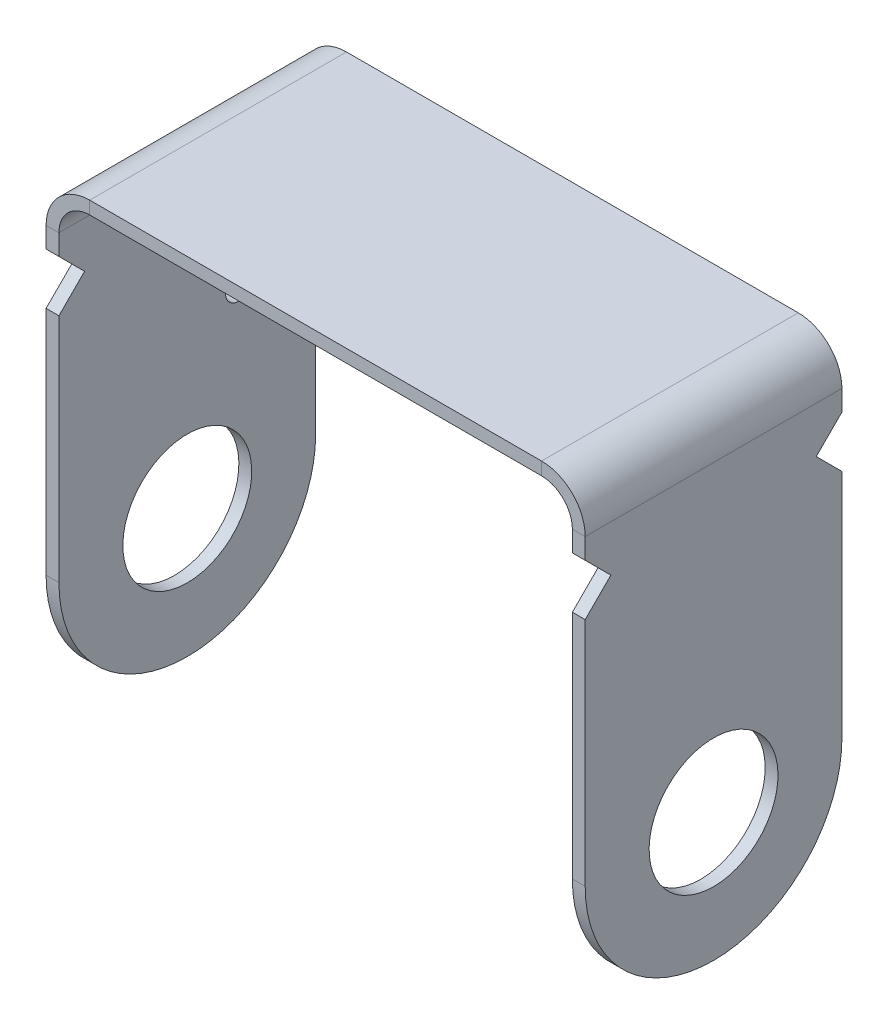
ISO-10303-21;
HEADER;
FILE_DESCRIPTION(('STEP AP214'),'2;1');
FILE_NAME('part.step','',(''),(''),'','','');
FILE_SCHEMA(('AUTOMOTIVE_DESIGN { 1 0 10303 214 1 1 1 1 }'));
ENDSEC;
DATA;
#1=APPLICATION_CONTEXT('core data for automotive mechanical design processes');
#2=APPLICATION_PROTOCOL_DEFINITION('international standard','automotive_design',2000,#1);
#3=PRODUCT_CONTEXT('',#1,'mechanical');
#4=PRODUCT('Part','Part','',(#3));
#5=PRODUCT_RELATED_PRODUCT_CATEGORY('part','',(#4));
#6=PRODUCT_DEFINITION_FORMATION('','',#4);
#7=PRODUCT_DEFINITION_CONTEXT('part definition',#1,'design');
#8=PRODUCT_DEFINITION('design','',#6,#7);
#9=PRODUCT_DEFINITION_SHAPE('','',#8);
#10=(LENGTH_UNIT() NAMED_UNIT(*) SI_UNIT(.MILLI.,.METRE.));
#11=(NAMED_UNIT(*) PLANE_ANGLE_UNIT() SI_UNIT($,.RADIAN.));
#12=(NAMED_UNIT(*) SI_UNIT($,.STERADIAN.) SOLID_ANGLE_UNIT());
#13=UNCERTAINTY_MEASURE_WITH_UNIT(LENGTH_MEASURE(1.E-05),#10,'distance_accuracy_value','');
#14=(GEOMETRIC_REPRESENTATION_CONTEXT(3) GLOBAL_UNCERTAINTY_ASSIGNED_CONTEXT((#13)) GLOBAL_UNIT_ASSIGNED_CONTEXT((#10,
#11,#12)) REPRESENTATION_CONTEXT('',''));
#15=CARTESIAN_POINT('',(0.,0.,0.));
#16=DIRECTION('',(0.,0.,1.));
#17=DIRECTION('',(1.,0.,0.));
#18=AXIS2_PLACEMENT_3D('',#15,#16,#17);
#19=CARTESIAN_POINT('',(-87.9999999999999,180.,-50.));
#20=DIRECTION('',(0.,0.,-1.));
#21=DIRECTION('',(-1.,0.,0.));
#22=AXIS2_PLACEMENT_3D('',#19,#20,#21);
#23=PLANE('',#22);
#24=DIRECTION('',(-1.,0.,0.));
#25=VECTOR('',#24,1.);
#26=CARTESIAN_POINT('',(105.,160.,-50.));
#27=LINE('',#26,#25);
#28=CARTESIAN_POINT('',(-100.,160.,-50.));
#29=VERTEX_POINT('',#28);
#30=CARTESIAN_POINT('',(-105.,160.,-50.));
#31=VERTEX_POINT('',#30);
#32=EDGE_CURVE('E238',#29,#31,#27,.T.);
#33=ORIENTED_EDGE('',*,*,#32,.T.);
#34=DIRECTION('',(0.,1.,0.));
#35=VECTOR('',#34,1.);
#36=CARTESIAN_POINT('',(-105.,0.,-50.));
#37=LINE('',#36,#35);
#38=CARTESIAN_POINT('',(-105.,168.,-50.0000000000001));
#39=VERTEX_POINT('',#38);
#40=EDGE_CURVE('E353',#31,#39,#37,.T.);
#41=ORIENTED_EDGE('',*,*,#40,.T.);
#42=DIRECTION('',(1.,0.,0.));
#43=VECTOR('',#42,1.);
#44=CARTESIAN_POINT('',(-105.,168.,-50.0000000000001));
#45=LINE('',#44,#43);
#46=CARTESIAN_POINT('',(-99.9999999999999,168.,-50.0000000000001));
#47=VERTEX_POINT('',#46);
#48=EDGE_CURVE('E401',#39,#47,#45,.T.);
#49=ORIENTED_EDGE('',*,*,#48,.T.);
#50=DIRECTION('',(0.,1.,0.));
#51=VECTOR('',#50,1.);
#52=CARTESIAN_POINT('',(-100.,0.,-50.));
#53=LINE('',#52,#51);
#54=EDGE_CURVE('E356',#29,#47,#53,.T.);
#55=ORIENTED_EDGE('',*,*,#54,.F.);
#56=EDGE_LOOP('',(#33,#41,#49,#55));
#57=FACE_BOUND('',#56,.T.);
#58=ADVANCED_FACE('F57',(#57),#23,.T.);
#59=CARTESIAN_POINT('',(88.0000000000001,180.,49.9999999999999));
#60=DIRECTION('',(0.,0.,1.));
#61=DIRECTION('',(1.,0.,0.));
#62=AXIS2_PLACEMENT_3D('',#59,#60,#61);
#63=PLANE('',#62);
#64=DIRECTION('',(-1.,0.,0.));
#65=VECTOR('',#64,1.);
#66=CARTESIAN_POINT('',(105.,160.,50.));
#67=LINE('',#66,#65);
#68=CARTESIAN_POINT('',(105.,160.,50.));
#69=VERTEX_POINT('',#68);
#70=CARTESIAN_POINT('',(100.,160.,50.));
#71=VERTEX_POINT('',#70);
#72=EDGE_CURVE('E272',#69,#71,#67,.T.);
#73=ORIENTED_EDGE('',*,*,#72,.F.);
#74=DIRECTION('',(0.,-1.,0.));
#75=VECTOR('',#74,1.);
#76=CARTESIAN_POINT('',(105.,185.,49.9999999999999));
#77=LINE('',#76,#75);
#78=CARTESIAN_POINT('',(105.,168.,50.));
#79=VERTEX_POINT('',#78);
#80=EDGE_CURVE('E311',#79,#69,#77,.T.);
#81=ORIENTED_EDGE('',*,*,#80,.F.);
#82=DIRECTION('',(-1.,0.,0.));
#83=VECTOR('',#82,1.);
#84=CARTESIAN_POINT('',(105.,168.,50.));
#85=LINE('',#84,#83);
#86=CARTESIAN_POINT('',(100.,168.,50.));
#87=VERTEX_POINT('',#86);
#88=EDGE_CURVE('E397',#79,#87,#85,.T.);
#89=ORIENTED_EDGE('',*,*,#88,.T.);
#90=DIRECTION('',(0.,1.,0.));
#91=VECTOR('',#90,1.);
#92=CARTESIAN_POINT('',(100.,185.,49.9999999999999));
#93=LINE('',#92,#91);
#94=EDGE_CURVE('E306',#87,#71,#93,.F.);
#95=ORIENTED_EDGE('',*,*,#94,.T.);
#96=EDGE_LOOP('',(#73,#81,#89,#95));
#97=FACE_BOUND('',#96,.T.);
#98=ADVANCED_FACE('F481',(#97),#63,.T.);
#99=CARTESIAN_POINT('',(88.0000000000001,168.,50.));
#100=DIRECTION('',(0.,0.,1.));
#101=DIRECTION('',(1.,0.,0.));
#102=AXIS2_PLACEMENT_3D('',#99,#100,#101);
#103=PLANE('',#102);
#104=DIRECTION('',(-1.,0.,0.));
#105=VECTOR('',#104,1.);
#106=CARTESIAN_POINT('',(88.,160.,50.));
#107=LINE('',#106,#105);
#108=CARTESIAN_POINT('',(-100.,160.,50.));
#109=VERTEX_POINT('',#108);
#110=CARTESIAN_POINT('',(-105.,160.,50.));
#111=VERTEX_POINT('',#110);
#112=EDGE_CURVE('E412',#109,#111,#107,.T.);
#113=ORIENTED_EDGE('',*,*,#112,.F.);
#114=DIRECTION('',(0.,1.,0.));
#115=VECTOR('',#114,1.);
#116=CARTESIAN_POINT('',(-100.,0.,50.));
#117=LINE('',#116,#115);
#118=CARTESIAN_POINT('',(-99.9999999999999,168.,50.));
#119=VERTEX_POINT('',#118);
#120=EDGE_CURVE('E326',#109,#119,#117,.T.);
#121=ORIENTED_EDGE('',*,*,#120,.T.);
#122=DIRECTION('',(-1.,0.,0.));
#123=VECTOR('',#122,1.);
#124=CARTESIAN_POINT('',(-99.9999999999999,168.,50.));
#125=LINE('',#124,#123);
#126=CARTESIAN_POINT('',(-105.,168.,50.));
#127=VERTEX_POINT('',#126);
#128=EDGE_CURVE('E404',#119,#127,#125,.T.);
#129=ORIENTED_EDGE('',*,*,#128,.T.);
#130=DIRECTION('',(0.,1.,0.));
#131=VECTOR('',#130,1.);
#132=CARTESIAN_POINT('',(-105.,0.,50.));
#133=LINE('',#132,#131);
#134=EDGE_CURVE('E323',#111,#127,#133,.T.);
#135=ORIENTED_EDGE('',*,*,#134,.F.);
#136=EDGE_LOOP('',(#113,#121,#129,#135));
#137=FACE_BOUND('',#136,.T.);
#138=ADVANCED_FACE('F488',(#137),#103,.T.);
#139=CARTESIAN_POINT('',(88.0000000000001,168.,-50.0000000000001));
#140=DIRECTION('',(0.,0.,1.));
#141=DIRECTION('',(1.,0.,0.));
#142=AXIS2_PLACEMENT_3D('',#139,#140,#141);
#143=PLANE('',#142);
#144=DIRECTION('',(0.,-1.,0.));
#145=VECTOR('',#144,1.);
#146=CARTESIAN_POINT('',(105.,185.,-50.0000000000001));
#147=LINE('',#146,#145);
#148=CARTESIAN_POINT('',(105.,168.,-50.0000000000001));
#149=VERTEX_POINT('',#148);
#150=CARTESIAN_POINT('',(105.,160.,-50.));
#151=VERTEX_POINT('',#150);
#152=EDGE_CURVE('E342',#149,#151,#147,.T.);
#153=ORIENTED_EDGE('',*,*,#152,.T.);
#154=CARTESIAN_POINT('',(100.,160.,-50.));
#155=VERTEX_POINT('',#154);
#156=EDGE_CURVE('E245',#151,#155,#27,.T.);
#157=ORIENTED_EDGE('',*,*,#156,.T.);
#158=DIRECTION('',(0.,1.,0.));
#159=VECTOR('',#158,1.);
#160=CARTESIAN_POINT('',(100.,185.,-50.0000000000001));
#161=LINE('',#160,#159);
#162=CARTESIAN_POINT('',(100.,168.,-50.0000000000001));
#163=VERTEX_POINT('',#162);
#164=EDGE_CURVE('E339',#163,#155,#161,.F.);
#165=ORIENTED_EDGE('',*,*,#164,.F.);
#166=DIRECTION('',(1.,0.,0.));
#167=VECTOR('',#166,1.);
#168=CARTESIAN_POINT('',(100.,168.,-50.0000000000001));
#169=LINE('',#168,#167);
#170=EDGE_CURVE('E391',#163,#149,#169,.T.);
#171=ORIENTED_EDGE('',*,*,#170,.T.);
#172=EDGE_LOOP('',(#153,#157,#165,#171));
#173=FACE_BOUND('',#172,.T.);
#174=ADVANCED_FACE('F619',(#173),#143,.F.);
#175=CARTESIAN_POINT('',(-87.9999999999999,185.,49.9999999999999));
#176=DIRECTION('',(0.,0.,1.));
#177=DIRECTION('',(1.,0.,0.));
#178=AXIS2_PLACEMENT_3D('',#175,#176,#177);
#179=PLANE('',#178);
#180=DIRECTION('',(0.,-1.,0.));
#181=VECTOR('',#180,1.);
#182=CARTESIAN_POINT('',(-87.9999999999999,185.,49.9999999999999));
#183=LINE('',#182,#181);
#184=CARTESIAN_POINT('',(-87.9999999999999,185.,49.9999999999999));
#185=VERTEX_POINT('',#184);
#186=CARTESIAN_POINT('',(-87.9999999999999,180.,49.9999999999999));
#187=VERTEX_POINT('',#186);
#188=EDGE_CURVE('E407',#185,#187,#183,.T.);
#189=ORIENTED_EDGE('',*,*,#188,.F.);
#190=CARTESIAN_POINT('',(-87.9999999999999,168.,50.));
#191=DIRECTION('',(0.,0.,1.));
#192=DIRECTION('',(1.,0.,0.));
#193=AXIS2_PLACEMENT_3D('',#190,#191,#192);
#194=CIRCLE('',#193,17.);
#195=EDGE_CURVE('E320',#127,#185,#194,.F.);
#196=ORIENTED_EDGE('',*,*,#195,.F.);
#197=ORIENTED_EDGE('',*,*,#128,.F.);
#198=CARTESIAN_POINT('',(-87.9999999999999,168.,50.));
#199=DIRECTION('',(0.,0.,1.));
#200=DIRECTION('',(1.,0.,0.));
#201=AXIS2_PLACEMENT_3D('',#198,#199,#200);
#202=CIRCLE('',#201,12.);
#203=EDGE_CURVE('E329',#119,#187,#202,.F.);
#204=ORIENTED_EDGE('',*,*,#203,.T.);
#205=EDGE_LOOP('',(#189,#196,#197,#204));
#206=FACE_BOUND('',#205,.T.);
#207=ADVANCED_FACE('F571',(#206),#179,.T.);
#208=CARTESIAN_POINT('',(-99.9999999999999,168.,50.));
#209=DIRECTION('',(0.,0.,1.));
#210=DIRECTION('',(1.,0.,0.));
#211=AXIS2_PLACEMENT_3D('',#208,#209,#210);
#212=PLANE('',#211);
#213=DIRECTION('',(1.,0.,0.));
#214=VECTOR('',#213,1.);
#215=CARTESIAN_POINT('',(-105.,185.,49.9999999999999));
#216=LINE('',#215,#214);
#217=CARTESIAN_POINT('',(88.0000000000001,185.,49.9999999999999));
#218=VERTEX_POINT('',#217);
#219=EDGE_CURVE('E317',#185,#218,#216,.T.);
#220=ORIENTED_EDGE('',*,*,#219,.F.);
#221=ORIENTED_EDGE('',*,*,#188,.T.);
#222=DIRECTION('',(1.,0.,0.));
#223=VECTOR('',#222,1.);
#224=CARTESIAN_POINT('',(-105.,180.,49.9999999999999));
#225=LINE('',#224,#223);
#226=CARTESIAN_POINT('',(88.0000000000001,180.,49.9999999999999));
#227=VERTEX_POINT('',#226);
#228=EDGE_CURVE('E332',#187,#227,#225,.T.);
#229=ORIENTED_EDGE('',*,*,#228,.T.);
#230=DIRECTION('',(0.,1.,0.));
#231=VECTOR('',#230,1.);
#232=CARTESIAN_POINT('',(88.0000000000001,180.,49.9999999999999));
#233=LINE('',#232,#231);
#234=EDGE_CURVE('E395',#227,#218,#233,.T.);
#235=ORIENTED_EDGE('',*,*,#234,.T.);
#236=EDGE_LOOP('',(#220,#221,#229,#235));
#237=FACE_BOUND('',#236,.T.);
#238=ADVANCED_FACE('F504',(#237),#212,.T.);
#239=CARTESIAN_POINT('',(-105.,168.,-50.0000000000001));
#240=DIRECTION('',(0.,0.,-1.));
#241=DIRECTION('',(-1.,0.,0.));
#242=AXIS2_PLACEMENT_3D('',#239,#240,#241);
#243=PLANE('',#242);
#244=ORIENTED_EDGE('',*,*,#48,.F.);
#245=CARTESIAN_POINT('',(-87.9999999999999,168.,-50.0000000000001));
#246=DIRECTION('',(0.,0.,1.));
#247=DIRECTION('',(1.,0.,0.));
#248=AXIS2_PLACEMENT_3D('',#245,#246,#247);
#249=CIRCLE('',#248,17.);
#250=CARTESIAN_POINT('',(-87.9999999999999,185.,-50.0000000000001));
#251=VERTEX_POINT('',#250);
#252=EDGE_CURVE('E350',#39,#251,#249,.F.);
#253=ORIENTED_EDGE('',*,*,#252,.T.);
#254=DIRECTION('',(0.,1.,0.));
#255=VECTOR('',#254,1.);
#256=CARTESIAN_POINT('',(-87.9999999999999,180.,-50.));
#257=LINE('',#256,#255);
#258=CARTESIAN_POINT('',(-87.9999999999999,180.,-50.));
#259=VERTEX_POINT('',#258);
#260=EDGE_CURVE('E399',#259,#251,#257,.T.);
#261=ORIENTED_EDGE('',*,*,#260,.F.);
#262=CARTESIAN_POINT('',(-87.9999999999999,168.,-50.0000000000001));
#263=DIRECTION('',(0.,0.,1.));
#264=DIRECTION('',(1.,0.,0.));
#265=AXIS2_PLACEMENT_3D('',#262,#263,#264);
#266=CIRCLE('',#265,12.);
#267=EDGE_CURVE('E359',#47,#259,#266,.F.);
#268=ORIENTED_EDGE('',*,*,#267,.F.);
#269=EDGE_LOOP('',(#244,#253,#261,#268));
#270=FACE_BOUND('',#269,.T.);
#271=ADVANCED_FACE('F497',(#270),#243,.T.);
#272=CARTESIAN_POINT('',(-100.,50.,-50.));
#273=VERTEX_POINT('',#272);
#274=CARTESIAN_POINT('',(-100.,140.,-50.));
#275=VERTEX_POINT('',#274);
#276=EDGE_CURVE('E357',#273,#275,#53,.T.);
#277=ORIENTED_EDGE('',*,*,#276,.F.);
#278=DIRECTION('',(-1.,0.,0.));
#279=VECTOR('',#278,1.);
#280=CARTESIAN_POINT('',(-88.,50.,-50.));
#281=LINE('',#280,#279);
#282=CARTESIAN_POINT('',(-105.,50.,-50.));
#283=VERTEX_POINT('',#282);
#284=EDGE_CURVE('E425',#273,#283,#281,.T.);
#285=ORIENTED_EDGE('',*,*,#284,.T.);
#286=CARTESIAN_POINT('',(-105.,140.,-50.));
#287=VERTEX_POINT('',#286);
#288=EDGE_CURVE('E354',#283,#287,#37,.T.);
#289=ORIENTED_EDGE('',*,*,#288,.T.);
#290=DIRECTION('',(-1.,0.,0.));
#291=VECTOR('',#290,1.);
#292=CARTESIAN_POINT('',(105.,140.,-50.));
#293=LINE('',#292,#291);
#294=EDGE_CURVE('E248',#275,#287,#293,.T.);
#295=ORIENTED_EDGE('',*,*,#294,.F.);
#296=EDGE_LOOP('',(#277,#285,#289,#295));
#297=FACE_BOUND('',#296,.T.);
#298=ADVANCED_FACE('F484',(#297),#23,.T.);
#299=CARTESIAN_POINT('',(105.,168.,50.));
#300=DIRECTION('',(0.,0.,1.));
#301=DIRECTION('',(1.,0.,0.));
#302=AXIS2_PLACEMENT_3D('',#299,#300,#301);
#303=PLANE('',#302);
#304=ORIENTED_EDGE('',*,*,#88,.F.);
#305=CARTESIAN_POINT('',(88.0000000000001,168.,50.));
#306=DIRECTION('',(0.,0.,1.));
#307=DIRECTION('',(1.,0.,0.));
#308=AXIS2_PLACEMENT_3D('',#305,#306,#307);
#309=CIRCLE('',#308,17.);
#310=EDGE_CURVE('E314',#218,#79,#309,.F.);
#311=ORIENTED_EDGE('',*,*,#310,.F.);
#312=ORIENTED_EDGE('',*,*,#234,.F.);
#313=CARTESIAN_POINT('',(88.0000000000001,168.,50.));
#314=DIRECTION('',(0.,0.,1.));
#315=DIRECTION('',(1.,0.,0.));
#316=AXIS2_PLACEMENT_3D('',#313,#314,#315);
#317=CIRCLE('',#316,12.);
#318=EDGE_CURVE('E335',#227,#87,#317,.F.);
#319=ORIENTED_EDGE('',*,*,#318,.T.);
#320=EDGE_LOOP('',(#304,#311,#312,#319));
#321=FACE_BOUND('',#320,.T.);
#322=ADVANCED_FACE('F496',(#321),#303,.T.);
#323=CARTESIAN_POINT('',(100.,140.,49.9999999999999));
#324=VERTEX_POINT('',#323);
#325=CARTESIAN_POINT('',(100.,50.,49.9999999999999));
#326=VERTEX_POINT('',#325);
#327=EDGE_CURVE('E310',#324,#326,#93,.F.);
#328=ORIENTED_EDGE('',*,*,#327,.T.);
#329=DIRECTION('',(-1.,0.,0.));
#330=VECTOR('',#329,1.);
#331=CARTESIAN_POINT('',(88.,50.,49.9999999999999));
#332=LINE('',#331,#330);
#333=CARTESIAN_POINT('',(105.,50.,49.9999999999999));
#334=VERTEX_POINT('',#333);
#335=EDGE_CURVE('E431',#326,#334,#332,.F.);
#336=ORIENTED_EDGE('',*,*,#335,.T.);
#337=CARTESIAN_POINT('',(105.,140.,49.9999999999999));
#338=VERTEX_POINT('',#337);
#339=EDGE_CURVE('E309',#338,#334,#77,.T.);
#340=ORIENTED_EDGE('',*,*,#339,.F.);
#341=DIRECTION('',(-1.,0.,0.));
#342=VECTOR('',#341,1.);
#343=CARTESIAN_POINT('',(105.,140.,49.9999999999999));
#344=LINE('',#343,#342);
#345=EDGE_CURVE('E269',#338,#324,#344,.T.);
#346=ORIENTED_EDGE('',*,*,#345,.T.);
#347=EDGE_LOOP('',(#328,#336,#340,#346));
#348=FACE_BOUND('',#347,.T.);
#349=ADVANCED_FACE('F491',(#348),#63,.T.);
#350=CARTESIAN_POINT('',(88.0000000000001,185.,-50.0000000000001));
#351=DIRECTION('',(0.,0.,-1.));
#352=DIRECTION('',(-1.,0.,0.));
#353=AXIS2_PLACEMENT_3D('',#350,#351,#352);
#354=PLANE('',#353);
#355=DIRECTION('',(0.,-1.,0.));
#356=VECTOR('',#355,1.);
#357=CARTESIAN_POINT('',(88.0000000000001,185.,-50.0000000000001));
#358=LINE('',#357,#356);
#359=CARTESIAN_POINT('',(88.0000000000001,185.,-50.0000000000001));
#360=VERTEX_POINT('',#359);
#361=CARTESIAN_POINT('',(88.0000000000001,180.,-50.));
#362=VERTEX_POINT('',#361);
#363=EDGE_CURVE('E393',#360,#362,#358,.T.);
#364=ORIENTED_EDGE('',*,*,#363,.F.);
#365=CARTESIAN_POINT('',(88.0000000000001,168.,-50.0000000000001));
#366=DIRECTION('',(0.,0.,1.));
#367=DIRECTION('',(1.,0.,0.));
#368=AXIS2_PLACEMENT_3D('',#365,#366,#367);
#369=CIRCLE('',#368,17.);
#370=EDGE_CURVE('E344',#360,#149,#369,.F.);
#371=ORIENTED_EDGE('',*,*,#370,.T.);
#372=ORIENTED_EDGE('',*,*,#170,.F.);
#373=CARTESIAN_POINT('',(88.0000000000001,168.,-50.0000000000001));
#374=DIRECTION('',(0.,0.,1.));
#375=DIRECTION('',(1.,0.,0.));
#376=AXIS2_PLACEMENT_3D('',#373,#374,#375);
#377=CIRCLE('',#376,12.);
#378=EDGE_CURVE('E365',#362,#163,#377,.F.);
#379=ORIENTED_EDGE('',*,*,#378,.F.);
#380=EDGE_LOOP('',(#364,#371,#372,#379));
#381=FACE_BOUND('',#380,.T.);
#382=ADVANCED_FACE('F557',(#381),#354,.T.);
#383=CARTESIAN_POINT('',(100.,168.,-50.0000000000001));
#384=DIRECTION('',(0.,0.,-1.));
#385=DIRECTION('',(-1.,0.,0.));
#386=AXIS2_PLACEMENT_3D('',#383,#384,#385);
#387=PLANE('',#386);
#388=DIRECTION('',(1.,0.,0.));
#389=VECTOR('',#388,1.);
#390=CARTESIAN_POINT('',(-105.,185.,-50.0000000000001));
#391=LINE('',#390,#389);
#392=EDGE_CURVE('E347',#251,#360,#391,.T.);
#393=ORIENTED_EDGE('',*,*,#392,.T.);
#394=ORIENTED_EDGE('',*,*,#363,.T.);
#395=DIRECTION('',(1.,0.,0.));
#396=VECTOR('',#395,1.);
#397=CARTESIAN_POINT('',(-105.,180.,-50.));
#398=LINE('',#397,#396);
#399=EDGE_CURVE('E362',#259,#362,#398,.T.);
#400=ORIENTED_EDGE('',*,*,#399,.F.);
#401=ORIENTED_EDGE('',*,*,#260,.T.);
#402=EDGE_LOOP('',(#393,#394,#400,#401));
#403=FACE_BOUND('',#402,.T.);
#404=ADVANCED_FACE('F540',(#403),#387,.T.);
#405=CARTESIAN_POINT('',(100.,185.,49.9999999999999));
#406=DIRECTION('',(1.,0.,0.));
#407=DIRECTION('',(0.,0.,-1.));
#408=AXIS2_PLACEMENT_3D('',#405,#406,#407);
#409=PLANE('',#408);
#410=CARTESIAN_POINT('',(100.,50.,0.));
#411=DIRECTION('',(1.,0.,0.));
#412=DIRECTION('',(0.,0.,-1.));
#413=AXIS2_PLACEMENT_3D('',#410,#411,#412);
#414=CIRCLE('',#413,25.1);
#415=CARTESIAN_POINT('',(100.,50.,-25.1000000000001));
#416=VERTEX_POINT('',#415);
#417=EDGE_CURVE('E441',#416,#416,#414,.T.);
#418=ORIENTED_EDGE('',*,*,#417,.T.);
#419=EDGE_LOOP('',(#418));
#420=FACE_BOUND('',#419,.T.);
#421=CARTESIAN_POINT('',(100.,50.,0.));
#422=DIRECTION('',(1.,0.,0.));
#423=DIRECTION('',(0.,0.,-1.));
#424=AXIS2_PLACEMENT_3D('',#421,#422,#423);
#425=CIRCLE('',#424,50.);
#426=CARTESIAN_POINT('',(100.,50.,-50.));
#427=VERTEX_POINT('',#426);
#428=CARTESIAN_POINT('',(100.,0.,0.));
#429=VERTEX_POINT('',#428);
#430=EDGE_CURVE('E427',#427,#429,#425,.F.);
#431=ORIENTED_EDGE('',*,*,#430,.T.);
#432=CARTESIAN_POINT('',(100.,50.,0.));
#433=DIRECTION('',(1.,0.,0.));
#434=DIRECTION('',(0.,0.,-1.));
#435=AXIS2_PLACEMENT_3D('',#432,#433,#434);
#436=CIRCLE('',#435,50.);
#437=EDGE_CURVE('E429',#429,#326,#436,.F.);
#438=ORIENTED_EDGE('',*,*,#437,.T.);
#439=ORIENTED_EDGE('',*,*,#327,.F.);
#440=DIRECTION('',(0.,0.707106781186547,-0.707106781186548));
#441=VECTOR('',#440,1.);
#442=CARTESIAN_POINT('',(100.,162.5,27.5));
#443=LINE('',#442,#441);
#444=CARTESIAN_POINT('',(100.,150.,39.9999999999999));
#445=VERTEX_POINT('',#444);
#446=EDGE_CURVE('E294',#324,#445,#443,.T.);
#447=ORIENTED_EDGE('',*,*,#446,.T.);
#448=DIRECTION('',(0.,0.707106781186547,0.707106781186549));
#449=VECTOR('',#448,1.);
#450=CARTESIAN_POINT('',(100.,172.5,62.4999999999999));
#451=LINE('',#450,#449);
#452=EDGE_CURVE('E302',#445,#71,#451,.T.);
#453=ORIENTED_EDGE('',*,*,#452,.T.);
#454=ORIENTED_EDGE('',*,*,#94,.F.);
#455=DIRECTION('',(0.,0.,-1.));
#456=VECTOR('',#455,1.);
#457=CARTESIAN_POINT('',(100.,168.,50.));
#458=LINE('',#457,#456);
#459=EDGE_CURVE('E338',#87,#163,#458,.T.);
#460=ORIENTED_EDGE('',*,*,#459,.T.);
#461=ORIENTED_EDGE('',*,*,#164,.T.);
#462=DIRECTION('',(0.,-0.707106781186547,0.707106781186549));
#463=VECTOR('',#462,1.);
#464=CARTESIAN_POINT('',(100.,122.5,-12.4999999999999));
#465=LINE('',#464,#463);
#466=CARTESIAN_POINT('',(100.,150.,-40.));
#467=VERTEX_POINT('',#466);
#468=EDGE_CURVE('E286',#155,#467,#465,.T.);
#469=ORIENTED_EDGE('',*,*,#468,.T.);
#470=DIRECTION('',(0.,-0.707106781186547,-0.707106781186548));
#471=VECTOR('',#470,1.);
#472=CARTESIAN_POINT('',(100.,212.5,22.5));
#473=LINE('',#472,#471);
#474=CARTESIAN_POINT('',(100.,140.,-50.));
#475=VERTEX_POINT('',#474);
#476=EDGE_CURVE('E235',#467,#475,#473,.T.);
#477=ORIENTED_EDGE('',*,*,#476,.T.);
#478=EDGE_CURVE('E305',#475,#427,#161,.F.);
#479=ORIENTED_EDGE('',*,*,#478,.T.);
#480=EDGE_LOOP('',(#431,#438,#439,#447,#453,#454,#460,#461,#469,#477,#479));
#481=FACE_BOUND('',#480,.T.);
#482=ADVANCED_FACE('F610',(#420,#481),#409,.F.);
#483=CARTESIAN_POINT('',(105.,185.,49.9999999999999));
#484=DIRECTION('',(1.,0.,0.));
#485=DIRECTION('',(0.,0.,-1.));
#486=AXIS2_PLACEMENT_3D('',#483,#484,#485);
#487=PLANE('',#486);
#488=CARTESIAN_POINT('',(105.,50.,0.));
#489=DIRECTION('',(-1.,0.,0.));
#490=DIRECTION('',(0.,-1.,0.));
#491=AXIS2_PLACEMENT_3D('',#488,#489,#490);
#492=CIRCLE('',#491,25.1);
#493=CARTESIAN_POINT('',(105.,24.9,0.));
#494=VERTEX_POINT('',#493);
#495=EDGE_CURVE('E982',#494,#494,#492,.T.);
#496=ORIENTED_EDGE('',*,*,#495,.T.);
#497=EDGE_LOOP('',(#496));
#498=FACE_BOUND('',#497,.T.);
#499=ORIENTED_EDGE('',*,*,#339,.T.);
#500=CARTESIAN_POINT('',(105.,50.,0.));
#501=DIRECTION('',(1.,0.,0.));
#502=DIRECTION('',(0.,0.,-1.));
#503=AXIS2_PLACEMENT_3D('',#500,#501,#502);
#504=CIRCLE('',#503,50.);
#505=CARTESIAN_POINT('',(105.,0.,0.));
#506=VERTEX_POINT('',#505);
#507=EDGE_CURVE('E66',#334,#506,#504,.T.);
#508=ORIENTED_EDGE('',*,*,#507,.T.);
#509=CARTESIAN_POINT('',(105.,50.,0.));
#510=DIRECTION('',(1.,0.,0.));
#511=DIRECTION('',(0.,0.,-1.));
#512=AXIS2_PLACEMENT_3D('',#509,#510,#511);
#513=CIRCLE('',#512,50.);
#514=CARTESIAN_POINT('',(105.,50.,-50.));
#515=VERTEX_POINT('',#514);
#516=EDGE_CURVE('E74',#506,#515,#513,.T.);
#517=ORIENTED_EDGE('',*,*,#516,.T.);
#518=CARTESIAN_POINT('',(105.,140.,-50.));
#519=VERTEX_POINT('',#518);
#520=EDGE_CURVE('E251',#519,#515,#147,.T.);
#521=ORIENTED_EDGE('',*,*,#520,.F.);
#522=DIRECTION('',(0.,0.707106781186547,0.707106781186548));
#523=VECTOR('',#522,1.);
#524=CARTESIAN_POINT('',(105.,150.,-40.));
#525=LINE('',#524,#523);
#526=CARTESIAN_POINT('',(105.,150.,-40.));
#527=VERTEX_POINT('',#526);
#528=EDGE_CURVE('E232',#519,#527,#525,.T.);
#529=ORIENTED_EDGE('',*,*,#528,.T.);
#530=DIRECTION('',(0.,0.707106781186547,-0.707106781186549));
#531=VECTOR('',#530,1.);
#532=CARTESIAN_POINT('',(105.,160.,-50.));
#533=LINE('',#532,#531);
#534=EDGE_CURVE('E242',#527,#151,#533,.T.);
#535=ORIENTED_EDGE('',*,*,#534,.T.);
#536=ORIENTED_EDGE('',*,*,#152,.F.);
#537=DIRECTION('',(0.,0.,-1.));
#538=VECTOR('',#537,1.);
#539=CARTESIAN_POINT('',(105.,168.,50.));
#540=LINE('',#539,#538);
#541=EDGE_CURVE('E388',#79,#149,#540,.T.);
#542=ORIENTED_EDGE('',*,*,#541,.F.);
#543=ORIENTED_EDGE('',*,*,#80,.T.);
#544=DIRECTION('',(0.,-0.707106781186547,-0.707106781186549));
#545=VECTOR('',#544,1.);
#546=CARTESIAN_POINT('',(105.,160.,50.));
#547=LINE('',#546,#545);
#548=CARTESIAN_POINT('',(105.,150.,39.9999999999999));
#549=VERTEX_POINT('',#548);
#550=EDGE_CURVE('E252',#69,#549,#547,.T.);
#551=ORIENTED_EDGE('',*,*,#550,.T.);
#552=DIRECTION('',(0.,-0.707106781186547,0.707106781186548));
#553=VECTOR('',#552,1.);
#554=CARTESIAN_POINT('',(105.,150.,39.9999999999999));
#555=LINE('',#554,#553);
#556=EDGE_CURVE('E255',#549,#338,#555,.T.);
#557=ORIENTED_EDGE('',*,*,#556,.T.);
#558=EDGE_LOOP('',(#499,#508,#517,#521,#529,#535,#536,#542,#543,#551,#557));
#559=FACE_BOUND('',#558,.T.);
#560=ADVANCED_FACE('F250',(#498,#559),#487,.T.);
#561=CARTESIAN_POINT('',(88.0000000000001,168.,50.));
#562=DIRECTION('',(0.,0.,-1.));
#563=DIRECTION('',(-1.,0.,0.));
#564=AXIS2_PLACEMENT_3D('',#561,#562,#563);
#565=CYLINDRICAL_SURFACE('',#564,17.);
#566=ORIENTED_EDGE('',*,*,#370,.F.);
#567=DIRECTION('',(0.,0.,-1.));
#568=VECTOR('',#567,1.);
#569=CARTESIAN_POINT('',(88.0000000000001,185.,49.9999999999999));
#570=LINE('',#569,#568);
#571=EDGE_CURVE('E385',#218,#360,#570,.T.);
#572=ORIENTED_EDGE('',*,*,#571,.F.);
#573=ORIENTED_EDGE('',*,*,#310,.T.);
#574=ORIENTED_EDGE('',*,*,#541,.T.);
#575=EDGE_LOOP('',(#566,#572,#573,#574));
#576=FACE_BOUND('',#575,.T.);
#577=ADVANCED_FACE('F554',(#576),#565,.T.);
#578=CARTESIAN_POINT('',(-105.,185.,49.9999999999999));
#579=DIRECTION('',(0.,1.,0.));
#580=DIRECTION('',(0.,0.,1.));
#581=AXIS2_PLACEMENT_3D('',#578,#579,#580);
#582=PLANE('',#581);
#583=ORIENTED_EDGE('',*,*,#392,.F.);
#584=DIRECTION('',(0.,0.,-1.));
#585=VECTOR('',#584,1.);
#586=CARTESIAN_POINT('',(-87.9999999999999,185.,49.9999999999999));
#587=LINE('',#586,#585);
#588=EDGE_CURVE('E382',#185,#251,#587,.T.);
#589=ORIENTED_EDGE('',*,*,#588,.F.);
#590=ORIENTED_EDGE('',*,*,#219,.T.);
#591=ORIENTED_EDGE('',*,*,#571,.T.);
#592=EDGE_LOOP('',(#583,#589,#590,#591));
#593=FACE_BOUND('',#592,.T.);
#594=ADVANCED_FACE('F549',(#593),#582,.T.);
#595=CARTESIAN_POINT('',(-87.9999999999999,168.,50.));
#596=DIRECTION('',(0.,0.,-1.));
#597=DIRECTION('',(-1.,0.,0.));
#598=AXIS2_PLACEMENT_3D('',#595,#596,#597);
#599=CYLINDRICAL_SURFACE('',#598,17.);
#600=ORIENTED_EDGE('',*,*,#252,.F.);
#601=DIRECTION('',(0.,0.,-1.));
#602=VECTOR('',#601,1.);
#603=CARTESIAN_POINT('',(-105.,168.,50.));
#604=LINE('',#603,#602);
#605=EDGE_CURVE('E379',#127,#39,#604,.T.);
#606=ORIENTED_EDGE('',*,*,#605,.F.);
#607=ORIENTED_EDGE('',*,*,#195,.T.);
#608=ORIENTED_EDGE('',*,*,#588,.T.);
#609=EDGE_LOOP('',(#600,#606,#607,#608));
#610=FACE_BOUND('',#609,.T.);
#611=ADVANCED_FACE('F544',(#610),#599,.T.);
#612=CARTESIAN_POINT('',(-105.,0.,50.));
#613=DIRECTION('',(-1.,0.,0.));
#614=DIRECTION('',(0.,-1.,0.));
#615=AXIS2_PLACEMENT_3D('',#612,#613,#614);
#616=PLANE('',#615);
#617=CARTESIAN_POINT('',(-105.,50.,0.));
#618=DIRECTION('',(-1.,0.,0.));
#619=DIRECTION('',(0.,-1.,0.));
#620=AXIS2_PLACEMENT_3D('',#617,#618,#619);
#621=CIRCLE('',#620,25.1);
#622=CARTESIAN_POINT('',(-105.,24.9,0.));
#623=VERTEX_POINT('',#622);
#624=EDGE_CURVE('E446',#623,#623,#621,.T.);
#625=ORIENTED_EDGE('',*,*,#624,.F.);
#626=EDGE_LOOP('',(#625));
#627=FACE_BOUND('',#626,.T.);
#628=CARTESIAN_POINT('',(-105.,115.,-20.));
#629=DIRECTION('',(-1.,0.,0.));
#630=DIRECTION('',(0.,0.,1.));
#631=AXIS2_PLACEMENT_3D('',#628,#629,#630);
#632=CIRCLE('',#631,5.09999999999999);
#633=CARTESIAN_POINT('',(-105.,115.,-14.9000000000001));
#634=VERTEX_POINT('',#633);
#635=EDGE_CURVE('E438',#634,#634,#632,.T.);
#636=ORIENTED_EDGE('',*,*,#635,.F.);
#637=EDGE_LOOP('',(#636));
#638=FACE_BOUND('',#637,.T.);
#639=CARTESIAN_POINT('',(-105.,50.,0.));
#640=DIRECTION('',(-1.,0.,0.));
#641=DIRECTION('',(0.,-1.,0.));
#642=AXIS2_PLACEMENT_3D('',#639,#640,#641);
#643=CIRCLE('',#642,50.);
#644=CARTESIAN_POINT('',(-105.,0.,0.));
#645=VERTEX_POINT('',#644);
#646=EDGE_CURVE('E414',#283,#645,#643,.T.);
#647=ORIENTED_EDGE('',*,*,#646,.T.);
#648=CARTESIAN_POINT('',(-105.,50.,0.));
#649=DIRECTION('',(-1.,0.,0.));
#650=DIRECTION('',(0.,-1.,0.));
#651=AXIS2_PLACEMENT_3D('',#648,#649,#650);
#652=CIRCLE('',#651,50.);
#653=CARTESIAN_POINT('',(-105.,50.,49.9999999999999));
#654=VERTEX_POINT('',#653);
#655=EDGE_CURVE('E416',#645,#654,#652,.T.);
#656=ORIENTED_EDGE('',*,*,#655,.T.);
#657=CARTESIAN_POINT('',(-105.,140.,49.9999999999999));
#658=VERTEX_POINT('',#657);
#659=EDGE_CURVE('E324',#654,#658,#133,.T.);
#660=ORIENTED_EDGE('',*,*,#659,.T.);
#661=DIRECTION('',(0.,-0.707106781186547,0.707106781186548));
#662=VECTOR('',#661,1.);
#663=CARTESIAN_POINT('',(-105.,70.0000000000001,120.));
#664=LINE('',#663,#662);
#665=CARTESIAN_POINT('',(-105.,150.,39.9999999999999));
#666=VERTEX_POINT('',#665);
#667=EDGE_CURVE('E291',#666,#658,#664,.T.);
#668=ORIENTED_EDGE('',*,*,#667,.F.);
#669=DIRECTION('',(0.,-0.707106781186547,-0.707106781186549));
#670=VECTOR('',#669,1.);
#671=CARTESIAN_POINT('',(-105.,80.0000000000003,-30.0000000000001));
#672=LINE('',#671,#670);
#673=EDGE_CURVE('E300',#111,#666,#672,.T.);
#674=ORIENTED_EDGE('',*,*,#673,.F.);
#675=ORIENTED_EDGE('',*,*,#134,.T.);
#676=ORIENTED_EDGE('',*,*,#605,.T.);
#677=ORIENTED_EDGE('',*,*,#40,.F.);
#678=DIRECTION('',(0.,0.707106781186547,-0.707106781186549));
#679=VECTOR('',#678,1.);
#680=CARTESIAN_POINT('',(-105.,30.0000000000002,80.0000000000001));
#681=LINE('',#680,#679);
#682=CARTESIAN_POINT('',(-105.,150.,-40.));
#683=VERTEX_POINT('',#682);
#684=EDGE_CURVE('E284',#683,#31,#681,.T.);
#685=ORIENTED_EDGE('',*,*,#684,.F.);
#686=DIRECTION('',(0.,0.707106781186547,0.707106781186548));
#687=VECTOR('',#686,1.);
#688=CARTESIAN_POINT('',(-105.,120.,-69.9999999999999));
#689=LINE('',#688,#687);
#690=EDGE_CURVE('E278',#287,#683,#689,.T.);
#691=ORIENTED_EDGE('',*,*,#690,.F.);
#692=ORIENTED_EDGE('',*,*,#288,.F.);
#693=EDGE_LOOP('',(#647,#656,#660,#668,#674,#675,#676,#677,#685,#691,#692));
#694=FACE_BOUND('',#693,.T.);
#695=ADVANCED_FACE('F517',(#627,#638,#694),#616,.T.);
#696=CARTESIAN_POINT('',(-100.,0.,50.));
#697=DIRECTION('',(-1.,0.,0.));
#698=DIRECTION('',(0.,-1.,0.));
#699=AXIS2_PLACEMENT_3D('',#696,#697,#698);
#700=PLANE('',#699);
#701=CARTESIAN_POINT('',(-100.,50.,0.));
#702=DIRECTION('',(-1.,0.,0.));
#703=DIRECTION('',(0.,-1.,0.));
#704=AXIS2_PLACEMENT_3D('',#701,#702,#703);
#705=CIRCLE('',#704,25.1);
#706=CARTESIAN_POINT('',(-100.,24.9,0.));
#707=VERTEX_POINT('',#706);
#708=EDGE_CURVE('E61',#707,#707,#705,.T.);
#709=ORIENTED_EDGE('',*,*,#708,.T.);
#710=EDGE_LOOP('',(#709));
#711=FACE_BOUND('',#710,.T.);
#712=CARTESIAN_POINT('',(-100.,115.,-20.));
#713=DIRECTION('',(-1.,0.,0.));
#714=DIRECTION('',(0.,-1.,0.));
#715=AXIS2_PLACEMENT_3D('',#712,#713,#714);
#716=CIRCLE('',#715,5.09999999999999);
#717=CARTESIAN_POINT('',(-100.,109.9,-20.));
#718=VERTEX_POINT('',#717);
#719=EDGE_CURVE('E258',#718,#718,#716,.T.);
#720=ORIENTED_EDGE('',*,*,#719,.T.);
#721=EDGE_LOOP('',(#720));
#722=FACE_BOUND('',#721,.T.);
#723=CARTESIAN_POINT('',(-100.,50.,49.9999999999999));
#724=VERTEX_POINT('',#723);
#725=CARTESIAN_POINT('',(-100.,140.,49.9999999999999));
#726=VERTEX_POINT('',#725);
#727=EDGE_CURVE('E327',#724,#726,#117,.T.);
#728=ORIENTED_EDGE('',*,*,#727,.F.);
#729=CARTESIAN_POINT('',(-100.,50.,0.));
#730=DIRECTION('',(-1.,0.,0.));
#731=DIRECTION('',(0.,-1.,0.));
#732=AXIS2_PLACEMENT_3D('',#729,#730,#731);
#733=CIRCLE('',#732,50.);
#734=CARTESIAN_POINT('',(-100.,0.,0.));
#735=VERTEX_POINT('',#734);
#736=EDGE_CURVE('E423',#724,#735,#733,.F.);
#737=ORIENTED_EDGE('',*,*,#736,.T.);
#738=CARTESIAN_POINT('',(-100.,50.,0.));
#739=DIRECTION('',(-1.,0.,0.));
#740=DIRECTION('',(0.,-1.,0.));
#741=AXIS2_PLACEMENT_3D('',#738,#739,#740);
#742=CIRCLE('',#741,50.);
#743=EDGE_CURVE('E421',#735,#273,#742,.F.);
#744=ORIENTED_EDGE('',*,*,#743,.T.);
#745=ORIENTED_EDGE('',*,*,#276,.T.);
#746=DIRECTION('',(0.,0.707106781186547,0.707106781186548));
#747=VECTOR('',#746,1.);
#748=CARTESIAN_POINT('',(-100.,120.,-69.9999999999999));
#749=LINE('',#748,#747);
#750=CARTESIAN_POINT('',(-100.,150.,-40.));
#751=VERTEX_POINT('',#750);
#752=EDGE_CURVE('E261',#275,#751,#749,.T.);
#753=ORIENTED_EDGE('',*,*,#752,.T.);
#754=DIRECTION('',(0.,0.707106781186547,-0.707106781186549));
#755=VECTOR('',#754,1.);
#756=CARTESIAN_POINT('',(-100.,30.0000000000002,80.0000000000001));
#757=LINE('',#756,#755);
#758=EDGE_CURVE('E281',#751,#29,#757,.T.);
#759=ORIENTED_EDGE('',*,*,#758,.T.);
#760=ORIENTED_EDGE('',*,*,#54,.T.);
#761=DIRECTION('',(0.,0.,-1.));
#762=VECTOR('',#761,1.);
#763=CARTESIAN_POINT('',(-99.9999999999999,168.,50.));
#764=LINE('',#763,#762);
#765=EDGE_CURVE('E376',#119,#47,#764,.T.);
#766=ORIENTED_EDGE('',*,*,#765,.F.);
#767=ORIENTED_EDGE('',*,*,#120,.F.);
#768=DIRECTION('',(0.,-0.707106781186547,-0.707106781186549));
#769=VECTOR('',#768,1.);
#770=CARTESIAN_POINT('',(-100.,80.0000000000003,-30.0000000000001));
#771=LINE('',#770,#769);
#772=CARTESIAN_POINT('',(-100.,150.,39.9999999999999));
#773=VERTEX_POINT('',#772);
#774=EDGE_CURVE('E297',#109,#773,#771,.T.);
#775=ORIENTED_EDGE('',*,*,#774,.T.);
#776=DIRECTION('',(0.,-0.707106781186547,0.707106781186548));
#777=VECTOR('',#776,1.);
#778=CARTESIAN_POINT('',(-100.,70.0000000000001,120.));
#779=LINE('',#778,#777);
#780=EDGE_CURVE('E288',#773,#726,#779,.T.);
#781=ORIENTED_EDGE('',*,*,#780,.T.);
#782=EDGE_LOOP('',(#728,#737,#744,#745,#753,#759,#760,#766,#767,#775,#781));
#783=FACE_BOUND('',#782,.T.);
#784=ADVANCED_FACE('F459',(#711,#722,#783),#700,.F.);
#785=CARTESIAN_POINT('',(-87.9999999999999,168.,50.));
#786=DIRECTION('',(0.,0.,-1.));
#787=DIRECTION('',(-1.,0.,0.));
#788=AXIS2_PLACEMENT_3D('',#785,#786,#787);
#789=CYLINDRICAL_SURFACE('',#788,12.);
#790=ORIENTED_EDGE('',*,*,#267,.T.);
#791=DIRECTION('',(0.,0.,-1.));
#792=VECTOR('',#791,1.);
#793=CARTESIAN_POINT('',(-87.9999999999999,180.,49.9999999999999));
#794=LINE('',#793,#792);
#795=EDGE_CURVE('E373',#187,#259,#794,.T.);
#796=ORIENTED_EDGE('',*,*,#795,.F.);
#797=ORIENTED_EDGE('',*,*,#203,.F.);
#798=ORIENTED_EDGE('',*,*,#765,.T.);
#799=EDGE_LOOP('',(#790,#796,#797,#798));
#800=FACE_BOUND('',#799,.T.);
#801=ADVANCED_FACE('F534',(#800),#789,.F.);
#802=CARTESIAN_POINT('',(-105.,180.,49.9999999999999));
#803=DIRECTION('',(0.,1.,0.));
#804=DIRECTION('',(0.,0.,1.));
#805=AXIS2_PLACEMENT_3D('',#802,#803,#804);
#806=PLANE('',#805);
#807=ORIENTED_EDGE('',*,*,#399,.T.);
#808=DIRECTION('',(0.,0.,-1.));
#809=VECTOR('',#808,1.);
#810=CARTESIAN_POINT('',(88.0000000000001,180.,49.9999999999999));
#811=LINE('',#810,#809);
#812=EDGE_CURVE('E370',#227,#362,#811,.T.);
#813=ORIENTED_EDGE('',*,*,#812,.F.);
#814=ORIENTED_EDGE('',*,*,#228,.F.);
#815=ORIENTED_EDGE('',*,*,#795,.T.);
#816=EDGE_LOOP('',(#807,#813,#814,#815));
#817=FACE_BOUND('',#816,.T.);
#818=ADVANCED_FACE('F561',(#817),#806,.F.);
#819=CARTESIAN_POINT('',(88.0000000000001,168.,50.));
#820=DIRECTION('',(0.,0.,-1.));
#821=DIRECTION('',(-1.,0.,0.));
#822=AXIS2_PLACEMENT_3D('',#819,#820,#821);
#823=CYLINDRICAL_SURFACE('',#822,12.);
#824=ORIENTED_EDGE('',*,*,#378,.T.);
#825=ORIENTED_EDGE('',*,*,#459,.F.);
#826=ORIENTED_EDGE('',*,*,#318,.F.);
#827=ORIENTED_EDGE('',*,*,#812,.T.);
#828=EDGE_LOOP('',(#824,#825,#826,#827));
#829=FACE_BOUND('',#828,.T.);
#830=ADVANCED_FACE('F565',(#829),#823,.F.);
#831=ORIENTED_EDGE('',*,*,#659,.F.);
#832=DIRECTION('',(-1.,0.,0.));
#833=VECTOR('',#832,1.);
#834=CARTESIAN_POINT('',(88.,50.,49.9999999999999));
#835=LINE('',#834,#833);
#836=EDGE_CURVE('E418',#654,#724,#835,.F.);
#837=ORIENTED_EDGE('',*,*,#836,.T.);
#838=ORIENTED_EDGE('',*,*,#727,.T.);
#839=DIRECTION('',(1.,0.,0.));
#840=VECTOR('',#839,1.);
#841=CARTESIAN_POINT('',(88.,140.,49.9999999999999));
#842=LINE('',#841,#840);
#843=EDGE_CURVE('E409',#658,#726,#842,.T.);
#844=ORIENTED_EDGE('',*,*,#843,.F.);
#845=EDGE_LOOP('',(#831,#837,#838,#844));
#846=FACE_BOUND('',#845,.T.);
#847=ADVANCED_FACE('F584',(#846),#103,.T.);
#848=ORIENTED_EDGE('',*,*,#520,.T.);
#849=DIRECTION('',(-1.,0.,0.));
#850=VECTOR('',#849,1.);
#851=CARTESIAN_POINT('',(100.,50.,-50.));
#852=LINE('',#851,#850);
#853=EDGE_CURVE('E13',#515,#427,#852,.T.);
#854=ORIENTED_EDGE('',*,*,#853,.T.);
#855=ORIENTED_EDGE('',*,*,#478,.F.);
#856=EDGE_CURVE('E263',#519,#475,#293,.T.);
#857=ORIENTED_EDGE('',*,*,#856,.F.);
#858=EDGE_LOOP('',(#848,#854,#855,#857));
#859=FACE_BOUND('',#858,.T.);
#860=ADVANCED_FACE('F616',(#859),#143,.F.);
#861=CARTESIAN_POINT('',(105.,150.,-40.));
#862=DIRECTION('',(0.,-0.707106781186548,0.707106781186547));
#863=DIRECTION('',(0.,-0.707106781186547,-0.707106781186548));
#864=AXIS2_PLACEMENT_3D('',#861,#862,#863);
#865=PLANE('',#864);
#866=DIRECTION('',(-1.,0.,0.));
#867=VECTOR('',#866,1.);
#868=CARTESIAN_POINT('',(105.,150.,-40.));
#869=LINE('',#868,#867);
#870=EDGE_CURVE('E228',#527,#467,#869,.T.);
#871=ORIENTED_EDGE('',*,*,#870,.F.);
#872=ORIENTED_EDGE('',*,*,#528,.F.);
#873=ORIENTED_EDGE('',*,*,#856,.T.);
#874=ORIENTED_EDGE('',*,*,#476,.F.);
#875=EDGE_LOOP('',(#871,#872,#873,#874));
#876=FACE_BOUND('',#875,.T.);
#877=ADVANCED_FACE('F230',(#876),#865,.F.);
#878=CARTESIAN_POINT('',(105.,160.,-50.));
#879=DIRECTION('',(0.,0.707106781186549,0.707106781186547));
#880=DIRECTION('',(0.,-0.707106781186547,0.707106781186549));
#881=AXIS2_PLACEMENT_3D('',#878,#879,#880);
#882=PLANE('',#881);
#883=ORIENTED_EDGE('',*,*,#156,.F.);
#884=ORIENTED_EDGE('',*,*,#534,.F.);
#885=ORIENTED_EDGE('',*,*,#870,.T.);
#886=ORIENTED_EDGE('',*,*,#468,.F.);
#887=EDGE_LOOP('',(#883,#884,#885,#886));
#888=FACE_BOUND('',#887,.T.);
#889=ADVANCED_FACE('F243',(#888),#882,.F.);
#890=CARTESIAN_POINT('',(105.,150.,39.9999999999999));
#891=DIRECTION('',(0.,-0.707106781186548,-0.707106781186547));
#892=DIRECTION('',(0.,0.707106781186547,-0.707106781186548));
#893=AXIS2_PLACEMENT_3D('',#890,#891,#892);
#894=PLANE('',#893);
#895=ORIENTED_EDGE('',*,*,#667,.T.);
#896=ORIENTED_EDGE('',*,*,#843,.T.);
#897=ORIENTED_EDGE('',*,*,#780,.F.);
#898=DIRECTION('',(-1.,0.,0.));
#899=VECTOR('',#898,1.);
#900=CARTESIAN_POINT('',(105.,150.,39.9999999999999));
#901=LINE('',#900,#899);
#902=EDGE_CURVE('E268',#773,#666,#901,.T.);
#903=ORIENTED_EDGE('',*,*,#902,.T.);
#904=EDGE_LOOP('',(#895,#896,#897,#903));
#905=FACE_BOUND('',#904,.T.);
#906=ADVANCED_FACE('F477',(#905),#894,.F.);
#907=CARTESIAN_POINT('',(105.,160.,50.));
#908=DIRECTION('',(0.,0.707106781186549,-0.707106781186547));
#909=DIRECTION('',(0.,0.707106781186547,0.707106781186549));
#910=AXIS2_PLACEMENT_3D('',#907,#908,#909);
#911=PLANE('',#910);
#912=ORIENTED_EDGE('',*,*,#673,.T.);
#913=ORIENTED_EDGE('',*,*,#902,.F.);
#914=ORIENTED_EDGE('',*,*,#774,.F.);
#915=ORIENTED_EDGE('',*,*,#112,.T.);
#916=EDGE_LOOP('',(#912,#913,#914,#915));
#917=FACE_BOUND('',#916,.T.);
#918=ADVANCED_FACE('F580',(#917),#911,.F.);
#919=ORIENTED_EDGE('',*,*,#684,.T.);
#920=ORIENTED_EDGE('',*,*,#32,.F.);
#921=ORIENTED_EDGE('',*,*,#758,.F.);
#922=EDGE_CURVE('E239',#751,#683,#869,.T.);
#923=ORIENTED_EDGE('',*,*,#922,.T.);
#924=EDGE_LOOP('',(#919,#920,#921,#923));
#925=FACE_BOUND('',#924,.T.);
#926=ADVANCED_FACE('F628',(#925),#882,.F.);
#927=ORIENTED_EDGE('',*,*,#690,.T.);
#928=ORIENTED_EDGE('',*,*,#922,.F.);
#929=ORIENTED_EDGE('',*,*,#752,.F.);
#930=ORIENTED_EDGE('',*,*,#294,.T.);
#931=EDGE_LOOP('',(#927,#928,#929,#930));
#932=FACE_BOUND('',#931,.T.);
#933=ADVANCED_FACE('F522',(#932),#865,.F.);
#934=EDGE_CURVE('E265',#549,#445,#901,.T.);
#935=ORIENTED_EDGE('',*,*,#934,.F.);
#936=ORIENTED_EDGE('',*,*,#550,.F.);
#937=ORIENTED_EDGE('',*,*,#72,.T.);
#938=ORIENTED_EDGE('',*,*,#452,.F.);
#939=EDGE_LOOP('',(#935,#936,#937,#938));
#940=FACE_BOUND('',#939,.T.);
#941=ADVANCED_FACE('F474',(#940),#911,.F.);
#942=ORIENTED_EDGE('',*,*,#345,.F.);
#943=ORIENTED_EDGE('',*,*,#556,.F.);
#944=ORIENTED_EDGE('',*,*,#934,.T.);
#945=ORIENTED_EDGE('',*,*,#446,.F.);
#946=EDGE_LOOP('',(#942,#943,#944,#945));
#947=FACE_BOUND('',#946,.T.);
#948=ADVANCED_FACE('F465',(#947),#894,.F.);
#949=CARTESIAN_POINT('',(-105.,115.,-20.));
#950=DIRECTION('',(-1.,0.,0.));
#951=DIRECTION('',(0.,0.,1.));
#952=AXIS2_PLACEMENT_3D('',#949,#950,#951);
#953=CYLINDRICAL_SURFACE('',#952,5.09999999999999);
#954=ORIENTED_EDGE('',*,*,#719,.F.);
#955=EDGE_LOOP('',(#954));
#956=FACE_BOUND('',#955,.T.);
#957=ORIENTED_EDGE('',*,*,#635,.T.);
#958=EDGE_LOOP('',(#957));
#959=FACE_BOUND('',#958,.T.);
#960=ADVANCED_FACE('F462',(#956,#959),#953,.F.);
#961=CARTESIAN_POINT('',(-88.,50.,0.));
#962=DIRECTION('',(-1.,0.,0.));
#963=DIRECTION('',(0.,-1.,0.));
#964=AXIS2_PLACEMENT_3D('',#961,#962,#963);
#965=CYLINDRICAL_SURFACE('',#964,50.);
#966=ORIENTED_EDGE('',*,*,#284,.F.);
#967=ORIENTED_EDGE('',*,*,#743,.F.);
#968=DIRECTION('',(-1.,0.,0.));
#969=VECTOR('',#968,1.);
#970=CARTESIAN_POINT('',(-100.,0.,0.));
#971=LINE('',#970,#969);
#972=EDGE_CURVE('E436',#645,#735,#971,.F.);
#973=ORIENTED_EDGE('',*,*,#972,.F.);
#974=ORIENTED_EDGE('',*,*,#646,.F.);
#975=EDGE_LOOP('',(#966,#967,#973,#974));
#976=FACE_BOUND('',#975,.T.);
#977=ADVANCED_FACE('F464',(#976),#965,.T.);
#978=CARTESIAN_POINT('',(-100.,50.,0.));
#979=DIRECTION('',(-1.,0.,0.));
#980=DIRECTION('',(0.,-1.,0.));
#981=AXIS2_PLACEMENT_3D('',#978,#979,#980);
#982=CYLINDRICAL_SURFACE('',#981,50.);
#983=ORIENTED_EDGE('',*,*,#736,.F.);
#984=ORIENTED_EDGE('',*,*,#836,.F.);
#985=ORIENTED_EDGE('',*,*,#655,.F.);
#986=ORIENTED_EDGE('',*,*,#972,.T.);
#987=EDGE_LOOP('',(#983,#984,#985,#986));
#988=FACE_BOUND('',#987,.T.);
#989=ADVANCED_FACE('F471',(#988),#982,.T.);
#990=CARTESIAN_POINT('',(88.,50.,0.));
#991=DIRECTION('',(1.,0.,0.));
#992=DIRECTION('',(0.,0.,-1.));
#993=AXIS2_PLACEMENT_3D('',#990,#991,#992);
#994=CYLINDRICAL_SURFACE('',#993,50.);
#995=ORIENTED_EDGE('',*,*,#853,.F.);
#996=ORIENTED_EDGE('',*,*,#516,.F.);
#997=DIRECTION('',(-1.,0.,0.));
#998=VECTOR('',#997,1.);
#999=CARTESIAN_POINT('',(105.,0.,0.));
#1000=LINE('',#999,#998);
#1001=EDGE_CURVE('E439',#429,#506,#1000,.F.);
#1002=ORIENTED_EDGE('',*,*,#1001,.F.);
#1003=ORIENTED_EDGE('',*,*,#430,.F.);
#1004=EDGE_LOOP('',(#995,#996,#1002,#1003));
#1005=FACE_BOUND('',#1004,.T.);
#1006=ADVANCED_FACE('F59',(#1005),#994,.T.);
#1007=CARTESIAN_POINT('',(105.,50.,0.));
#1008=DIRECTION('',(-1.,0.,0.));
#1009=DIRECTION('',(0.,0.,1.));
#1010=AXIS2_PLACEMENT_3D('',#1007,#1008,#1009);
#1011=CYLINDRICAL_SURFACE('',#1010,50.);
#1012=ORIENTED_EDGE('',*,*,#507,.F.);
#1013=ORIENTED_EDGE('',*,*,#335,.F.);
#1014=ORIENTED_EDGE('',*,*,#437,.F.);
#1015=ORIENTED_EDGE('',*,*,#1001,.T.);
#1016=EDGE_LOOP('',(#1012,#1013,#1014,#1015));
#1017=FACE_BOUND('',#1016,.T.);
#1018=ADVANCED_FACE('F592',(#1017),#1011,.T.);
#1019=CARTESIAN_POINT('',(105.,50.,0.));
#1020=DIRECTION('',(-1.,0.,0.));
#1021=DIRECTION('',(0.,-1.,0.));
#1022=AXIS2_PLACEMENT_3D('',#1019,#1020,#1021);
#1023=CYLINDRICAL_SURFACE('',#1022,25.1);
#1024=ORIENTED_EDGE('',*,*,#624,.T.);
#1025=EDGE_LOOP('',(#1024));
#1026=FACE_BOUND('',#1025,.T.);
#1027=ORIENTED_EDGE('',*,*,#708,.F.);
#1028=EDGE_LOOP('',(#1027));
#1029=FACE_BOUND('',#1028,.T.);
#1030=ADVANCED_FACE('F597',(#1026,#1029),#1023,.F.);
#1031=ORIENTED_EDGE('',*,*,#495,.F.);
#1032=EDGE_LOOP('',(#1031));
#1033=FACE_BOUND('',#1032,.T.);
#1034=ORIENTED_EDGE('',*,*,#417,.F.);
#1035=EDGE_LOOP('',(#1034));
#1036=FACE_BOUND('',#1035,.T.);
#1037=ADVANCED_FACE('F601',(#1033,#1036),#1023,.F.);
#1038=CLOSED_SHELL('',(#58,#98,#138,#174,#207,#238,#271,#298,#322,#349,#382,#404,#482,#560,#577,
#594,#611,#695,#784,#801,#818,#830,#847,#860,#877,#889,#906,#918,#926,#933,#941,#948,#960,#977,
#989,#1006,#1018,#1030,#1037));
#1039=MANIFOLD_SOLID_BREP('B2',#1038);
#1040=ADVANCED_BREP_SHAPE_REPRESENTATION('',(#18,#1039),#14);
#1041=SHAPE_DEFINITION_REPRESENTATION(#9,#1040);
ENDSEC;
END-ISO-10303-21;
